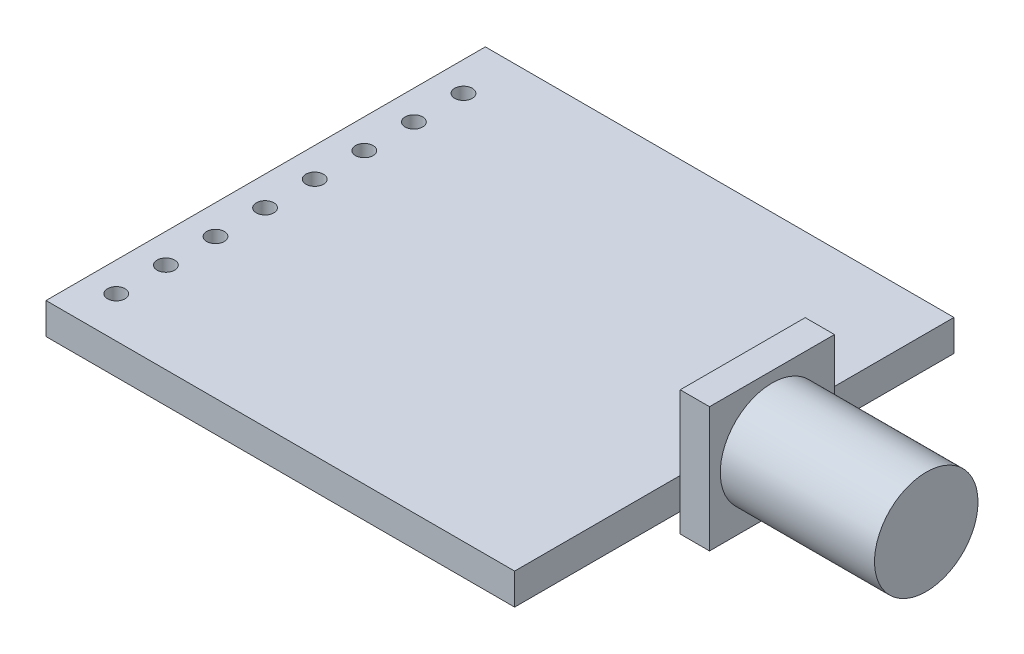
ISO-10303-21;
HEADER;
FILE_DESCRIPTION(('STEP AP214'),'2;1');
FILE_NAME('part.step','',(''),(''),'','','');
FILE_SCHEMA(('AUTOMOTIVE_DESIGN { 1 0 10303 214 1 1 1 1 }'));
ENDSEC;
DATA;
#1=APPLICATION_CONTEXT('core data for automotive mechanical design processes');
#2=APPLICATION_PROTOCOL_DEFINITION('international standard','automotive_design',2000,#1);
#3=PRODUCT_CONTEXT('',#1,'mechanical');
#4=PRODUCT('Part','Part','',(#3));
#5=PRODUCT_RELATED_PRODUCT_CATEGORY('part','',(#4));
#6=PRODUCT_DEFINITION_FORMATION('','',#4);
#7=PRODUCT_DEFINITION_CONTEXT('part definition',#1,'design');
#8=PRODUCT_DEFINITION('design','',#6,#7);
#9=PRODUCT_DEFINITION_SHAPE('','',#8);
#10=(LENGTH_UNIT() NAMED_UNIT(*) SI_UNIT(.MILLI.,.METRE.));
#11=(NAMED_UNIT(*) PLANE_ANGLE_UNIT() SI_UNIT($,.RADIAN.));
#12=(NAMED_UNIT(*) SI_UNIT($,.STERADIAN.) SOLID_ANGLE_UNIT());
#13=UNCERTAINTY_MEASURE_WITH_UNIT(LENGTH_MEASURE(1.E-05),#10,'distance_accuracy_value','');
#14=(GEOMETRIC_REPRESENTATION_CONTEXT(3) GLOBAL_UNCERTAINTY_ASSIGNED_CONTEXT((#13)) GLOBAL_UNIT_ASSIGNED_CONTEXT((#10,
#11,#12)) REPRESENTATION_CONTEXT('',''));
#15=CARTESIAN_POINT('',(0.,0.,0.));
#16=DIRECTION('',(0.,0.,1.));
#17=DIRECTION('',(1.,0.,0.));
#18=AXIS2_PLACEMENT_3D('',#15,#16,#17);
#19=CARTESIAN_POINT('',(-10.5,-1.,-8.63));
#20=DIRECTION('',(0.,1.,0.));
#21=DIRECTION('',(0.,0.,1.));
#22=AXIS2_PLACEMENT_3D('',#19,#20,#21);
#23=CYLINDRICAL_SURFACE('',#22,0.45);
#24=CARTESIAN_POINT('',(-10.5,1.6,-8.63));
#25=DIRECTION('',(0.,1.,0.));
#26=DIRECTION('',(0.,0.,1.));
#27=AXIS2_PLACEMENT_3D('',#24,#25,#26);
#28=CIRCLE('',#27,0.45);
#29=CARTESIAN_POINT('',(-10.5,1.6,-8.18));
#30=VERTEX_POINT('',#29);
#31=EDGE_CURVE('E49',#30,#30,#28,.T.);
#32=ORIENTED_EDGE('',*,*,#31,.T.);
#33=EDGE_LOOP('',(#32));
#34=FACE_BOUND('',#33,.T.);
#35=CARTESIAN_POINT('',(-10.5,0.,-8.63));
#36=DIRECTION('',(0.,1.,0.));
#37=DIRECTION('',(0.,0.,1.));
#38=AXIS2_PLACEMENT_3D('',#35,#36,#37);
#39=CIRCLE('',#38,0.45);
#40=CARTESIAN_POINT('',(-10.5,0.,-8.18));
#41=VERTEX_POINT('',#40);
#42=EDGE_CURVE('E11',#41,#41,#39,.T.);
#43=ORIENTED_EDGE('',*,*,#42,.F.);
#44=EDGE_LOOP('',(#43));
#45=FACE_BOUND('',#44,.T.);
#46=ADVANCED_FACE('F41',(#34,#45),#23,.F.);
#47=CARTESIAN_POINT('',(-10.5,-1.,-6.09));
#48=DIRECTION('',(0.,1.,0.));
#49=DIRECTION('',(0.,0.,1.));
#50=AXIS2_PLACEMENT_3D('',#47,#48,#49);
#51=CYLINDRICAL_SURFACE('',#50,0.45);
#52=CARTESIAN_POINT('',(-10.5,1.6,-6.09));
#53=DIRECTION('',(0.,1.,0.));
#54=DIRECTION('',(0.,0.,1.));
#55=AXIS2_PLACEMENT_3D('',#52,#53,#54);
#56=CIRCLE('',#55,0.45);
#57=CARTESIAN_POINT('',(-10.5,1.6,-5.64));
#58=VERTEX_POINT('',#57);
#59=EDGE_CURVE('E238',#58,#58,#56,.T.);
#60=ORIENTED_EDGE('',*,*,#59,.T.);
#61=EDGE_LOOP('',(#60));
#62=FACE_BOUND('',#61,.T.);
#63=CARTESIAN_POINT('',(-10.5,0.,-6.09));
#64=DIRECTION('',(0.,1.,0.));
#65=DIRECTION('',(0.,0.,1.));
#66=AXIS2_PLACEMENT_3D('',#63,#64,#65);
#67=CIRCLE('',#66,0.45);
#68=CARTESIAN_POINT('',(-10.5,0.,-5.64));
#69=VERTEX_POINT('',#68);
#70=EDGE_CURVE('E242',#69,#69,#67,.T.);
#71=ORIENTED_EDGE('',*,*,#70,.F.);
#72=EDGE_LOOP('',(#71));
#73=FACE_BOUND('',#72,.T.);
#74=ADVANCED_FACE('F271',(#62,#73),#51,.F.);
#75=CARTESIAN_POINT('',(-10.5,-1.,-3.55));
#76=DIRECTION('',(0.,1.,0.));
#77=DIRECTION('',(0.,0.,1.));
#78=AXIS2_PLACEMENT_3D('',#75,#76,#77);
#79=CYLINDRICAL_SURFACE('',#78,0.45);
#80=CARTESIAN_POINT('',(-10.5,1.6,-3.55));
#81=DIRECTION('',(0.,1.,0.));
#82=DIRECTION('',(0.,0.,1.));
#83=AXIS2_PLACEMENT_3D('',#80,#81,#82);
#84=CIRCLE('',#83,0.45);
#85=CARTESIAN_POINT('',(-10.5,1.6,-3.1));
#86=VERTEX_POINT('',#85);
#87=EDGE_CURVE('E230',#86,#86,#84,.T.);
#88=ORIENTED_EDGE('',*,*,#87,.T.);
#89=EDGE_LOOP('',(#88));
#90=FACE_BOUND('',#89,.T.);
#91=CARTESIAN_POINT('',(-10.5,0.,-3.55));
#92=DIRECTION('',(0.,1.,0.));
#93=DIRECTION('',(0.,0.,1.));
#94=AXIS2_PLACEMENT_3D('',#91,#92,#93);
#95=CIRCLE('',#94,0.45);
#96=CARTESIAN_POINT('',(-10.5,0.,-3.1));
#97=VERTEX_POINT('',#96);
#98=EDGE_CURVE('E234',#97,#97,#95,.T.);
#99=ORIENTED_EDGE('',*,*,#98,.F.);
#100=EDGE_LOOP('',(#99));
#101=FACE_BOUND('',#100,.T.);
#102=ADVANCED_FACE('F275',(#90,#101),#79,.F.);
#103=CARTESIAN_POINT('',(-10.5,-1.,-1.01));
#104=DIRECTION('',(0.,1.,0.));
#105=DIRECTION('',(0.,0.,1.));
#106=AXIS2_PLACEMENT_3D('',#103,#104,#105);
#107=CYLINDRICAL_SURFACE('',#106,0.45);
#108=CARTESIAN_POINT('',(-10.5,1.6,-1.01));
#109=DIRECTION('',(0.,1.,0.));
#110=DIRECTION('',(0.,0.,1.));
#111=AXIS2_PLACEMENT_3D('',#108,#109,#110);
#112=CIRCLE('',#111,0.45);
#113=CARTESIAN_POINT('',(-10.5,1.6,-0.56));
#114=VERTEX_POINT('',#113);
#115=EDGE_CURVE('E222',#114,#114,#112,.T.);
#116=ORIENTED_EDGE('',*,*,#115,.T.);
#117=EDGE_LOOP('',(#116));
#118=FACE_BOUND('',#117,.T.);
#119=CARTESIAN_POINT('',(-10.5,0.,-1.01));
#120=DIRECTION('',(0.,1.,0.));
#121=DIRECTION('',(0.,0.,1.));
#122=AXIS2_PLACEMENT_3D('',#119,#120,#121);
#123=CIRCLE('',#122,0.45);
#124=CARTESIAN_POINT('',(-10.5,0.,-0.56));
#125=VERTEX_POINT('',#124);
#126=EDGE_CURVE('E226',#125,#125,#123,.T.);
#127=ORIENTED_EDGE('',*,*,#126,.F.);
#128=EDGE_LOOP('',(#127));
#129=FACE_BOUND('',#128,.T.);
#130=ADVANCED_FACE('F280',(#118,#129),#107,.F.);
#131=CARTESIAN_POINT('',(-10.5,-1.,1.53));
#132=DIRECTION('',(0.,1.,0.));
#133=DIRECTION('',(0.,0.,1.));
#134=AXIS2_PLACEMENT_3D('',#131,#132,#133);
#135=CYLINDRICAL_SURFACE('',#134,0.45);
#136=CARTESIAN_POINT('',(-10.5,1.6,1.53));
#137=DIRECTION('',(0.,1.,0.));
#138=DIRECTION('',(0.,0.,1.));
#139=AXIS2_PLACEMENT_3D('',#136,#137,#138);
#140=CIRCLE('',#139,0.45);
#141=CARTESIAN_POINT('',(-10.5,1.6,1.98));
#142=VERTEX_POINT('',#141);
#143=EDGE_CURVE('E214',#142,#142,#140,.T.);
#144=ORIENTED_EDGE('',*,*,#143,.T.);
#145=EDGE_LOOP('',(#144));
#146=FACE_BOUND('',#145,.T.);
#147=CARTESIAN_POINT('',(-10.5,0.,1.53));
#148=DIRECTION('',(0.,1.,0.));
#149=DIRECTION('',(0.,0.,1.));
#150=AXIS2_PLACEMENT_3D('',#147,#148,#149);
#151=CIRCLE('',#150,0.45);
#152=CARTESIAN_POINT('',(-10.5,0.,1.98));
#153=VERTEX_POINT('',#152);
#154=EDGE_CURVE('E218',#153,#153,#151,.T.);
#155=ORIENTED_EDGE('',*,*,#154,.F.);
#156=EDGE_LOOP('',(#155));
#157=FACE_BOUND('',#156,.T.);
#158=ADVANCED_FACE('F287',(#146,#157),#135,.F.);
#159=CARTESIAN_POINT('',(-10.5,-1.,4.07));
#160=DIRECTION('',(0.,1.,0.));
#161=DIRECTION('',(0.,0.,1.));
#162=AXIS2_PLACEMENT_3D('',#159,#160,#161);
#163=CYLINDRICAL_SURFACE('',#162,0.45);
#164=CARTESIAN_POINT('',(-10.5,1.6,4.07));
#165=DIRECTION('',(0.,1.,0.));
#166=DIRECTION('',(0.,0.,1.));
#167=AXIS2_PLACEMENT_3D('',#164,#165,#166);
#168=CIRCLE('',#167,0.45);
#169=CARTESIAN_POINT('',(-10.5,1.6,4.52));
#170=VERTEX_POINT('',#169);
#171=EDGE_CURVE('E205',#170,#170,#168,.T.);
#172=ORIENTED_EDGE('',*,*,#171,.T.);
#173=EDGE_LOOP('',(#172));
#174=FACE_BOUND('',#173,.T.);
#175=CARTESIAN_POINT('',(-10.5,0.,4.07));
#176=DIRECTION('',(0.,1.,0.));
#177=DIRECTION('',(0.,0.,1.));
#178=AXIS2_PLACEMENT_3D('',#175,#176,#177);
#179=CIRCLE('',#178,0.45);
#180=CARTESIAN_POINT('',(-10.5,0.,4.52));
#181=VERTEX_POINT('',#180);
#182=EDGE_CURVE('E209',#181,#181,#179,.T.);
#183=ORIENTED_EDGE('',*,*,#182,.F.);
#184=EDGE_LOOP('',(#183));
#185=FACE_BOUND('',#184,.T.);
#186=ADVANCED_FACE('F291',(#174,#185),#163,.F.);
#187=CARTESIAN_POINT('',(12.,1.6,-11.25));
#188=DIRECTION('',(-1.,0.,0.));
#189=DIRECTION('',(0.,0.,1.));
#190=AXIS2_PLACEMENT_3D('',#187,#188,#189);
#191=PLANE('',#190);
#192=DIRECTION('',(0.,1.,0.));
#193=VECTOR('',#192,1.);
#194=CARTESIAN_POINT('',(12.,5.4,-3.63104152668825));
#195=LINE('',#194,#193);
#196=CARTESIAN_POINT('',(12.,0.,-3.63104152668825));
#197=VERTEX_POINT('',#196);
#198=CARTESIAN_POINT('',(12.,1.6,-3.63104152668825));
#199=VERTEX_POINT('',#198);
#200=EDGE_CURVE('E343',#197,#199,#195,.T.);
#201=ORIENTED_EDGE('',*,*,#200,.F.);
#202=DIRECTION('',(0.,0.,-1.));
#203=VECTOR('',#202,1.);
#204=CARTESIAN_POINT('',(12.,0.,-11.25));
#205=LINE('',#204,#203);
#206=CARTESIAN_POINT('',(12.,0.,-11.25));
#207=VERTEX_POINT('',#206);
#208=EDGE_CURVE('E149',#197,#207,#205,.T.);
#209=ORIENTED_EDGE('',*,*,#208,.T.);
#210=DIRECTION('',(0.,-1.,0.));
#211=VECTOR('',#210,1.);
#212=CARTESIAN_POINT('',(12.,1.6,-11.25));
#213=LINE('',#212,#211);
#214=CARTESIAN_POINT('',(12.,1.6,-11.25));
#215=VERTEX_POINT('',#214);
#216=EDGE_CURVE('E195',#215,#207,#213,.T.);
#217=ORIENTED_EDGE('',*,*,#216,.F.);
#218=DIRECTION('',(0.,0.,-1.));
#219=VECTOR('',#218,1.);
#220=CARTESIAN_POINT('',(12.,1.6,-11.25));
#221=LINE('',#220,#219);
#222=EDGE_CURVE('E56',#199,#215,#221,.T.);
#223=ORIENTED_EDGE('',*,*,#222,.F.);
#224=EDGE_LOOP('',(#201,#209,#217,#223));
#225=FACE_BOUND('',#224,.T.);
#226=ADVANCED_FACE('F295',(#225),#191,.F.);
#227=DIRECTION('',(0.,-1.,0.));
#228=VECTOR('',#227,1.);
#229=CARTESIAN_POINT('',(12.,5.4,2.76895847331175));
#230=LINE('',#229,#228);
#231=CARTESIAN_POINT('',(12.,1.6,2.76895847331175));
#232=VERTEX_POINT('',#231);
#233=CARTESIAN_POINT('',(12.,0.,2.76895847331175));
#234=VERTEX_POINT('',#233);
#235=EDGE_CURVE('E64',#232,#234,#230,.T.);
#236=ORIENTED_EDGE('',*,*,#235,.F.);
#237=CARTESIAN_POINT('',(12.,1.6,11.25));
#238=VERTEX_POINT('',#237);
#239=EDGE_CURVE('E160',#238,#232,#221,.T.);
#240=ORIENTED_EDGE('',*,*,#239,.F.);
#241=DIRECTION('',(0.,-1.,0.));
#242=VECTOR('',#241,1.);
#243=CARTESIAN_POINT('',(12.,1.6,11.25));
#244=LINE('',#243,#242);
#245=CARTESIAN_POINT('',(12.,0.,11.25));
#246=VERTEX_POINT('',#245);
#247=EDGE_CURVE('E172',#238,#246,#244,.T.);
#248=ORIENTED_EDGE('',*,*,#247,.T.);
#249=EDGE_CURVE('E155',#246,#234,#205,.T.);
#250=ORIENTED_EDGE('',*,*,#249,.T.);
#251=EDGE_LOOP('',(#236,#240,#248,#250));
#252=FACE_BOUND('',#251,.T.);
#253=ADVANCED_FACE('F299',(#252),#191,.F.);
#254=CARTESIAN_POINT('',(-12.,1.6,-11.25));
#255=DIRECTION('',(0.,0.,1.));
#256=DIRECTION('',(1.,0.,0.));
#257=AXIS2_PLACEMENT_3D('',#254,#255,#256);
#258=PLANE('',#257);
#259=DIRECTION('',(-1.,0.,0.));
#260=VECTOR('',#259,1.);
#261=CARTESIAN_POINT('',(-12.,0.,-11.25));
#262=LINE('',#261,#260);
#263=CARTESIAN_POINT('',(-12.,0.,-11.25));
#264=VERTEX_POINT('',#263);
#265=EDGE_CURVE('E175',#207,#264,#262,.T.);
#266=ORIENTED_EDGE('',*,*,#265,.T.);
#267=DIRECTION('',(0.,-1.,0.));
#268=VECTOR('',#267,1.);
#269=CARTESIAN_POINT('',(-12.,1.6,-11.25));
#270=LINE('',#269,#268);
#271=CARTESIAN_POINT('',(-12.,1.6,-11.25));
#272=VERTEX_POINT('',#271);
#273=EDGE_CURVE('E191',#272,#264,#270,.T.);
#274=ORIENTED_EDGE('',*,*,#273,.F.);
#275=DIRECTION('',(-1.,0.,0.));
#276=VECTOR('',#275,1.);
#277=CARTESIAN_POINT('',(-12.,1.6,-11.25));
#278=LINE('',#277,#276);
#279=EDGE_CURVE('E163',#215,#272,#278,.T.);
#280=ORIENTED_EDGE('',*,*,#279,.F.);
#281=ORIENTED_EDGE('',*,*,#216,.T.);
#282=EDGE_LOOP('',(#266,#274,#280,#281));
#283=FACE_BOUND('',#282,.T.);
#284=ADVANCED_FACE('F300',(#283),#258,.F.);
#285=CARTESIAN_POINT('',(-12.,1.6,-11.25));
#286=DIRECTION('',(1.,0.,0.));
#287=DIRECTION('',(0.,0.,-1.));
#288=AXIS2_PLACEMENT_3D('',#285,#286,#287);
#289=PLANE('',#288);
#290=DIRECTION('',(0.,0.,1.));
#291=VECTOR('',#290,1.);
#292=CARTESIAN_POINT('',(-12.,0.,-11.25));
#293=LINE('',#292,#291);
#294=CARTESIAN_POINT('',(-12.,0.,11.25));
#295=VERTEX_POINT('',#294);
#296=EDGE_CURVE('E178',#264,#295,#293,.T.);
#297=ORIENTED_EDGE('',*,*,#296,.T.);
#298=DIRECTION('',(0.,-1.,0.));
#299=VECTOR('',#298,1.);
#300=CARTESIAN_POINT('',(-12.,1.6,11.25));
#301=LINE('',#300,#299);
#302=CARTESIAN_POINT('',(-12.,1.6,11.25));
#303=VERTEX_POINT('',#302);
#304=EDGE_CURVE('E187',#303,#295,#301,.T.);
#305=ORIENTED_EDGE('',*,*,#304,.F.);
#306=DIRECTION('',(0.,0.,1.));
#307=VECTOR('',#306,1.);
#308=CARTESIAN_POINT('',(-12.,1.6,-11.25));
#309=LINE('',#308,#307);
#310=EDGE_CURVE('E167',#272,#303,#309,.T.);
#311=ORIENTED_EDGE('',*,*,#310,.F.);
#312=ORIENTED_EDGE('',*,*,#273,.T.);
#313=EDGE_LOOP('',(#297,#305,#311,#312));
#314=FACE_BOUND('',#313,.T.);
#315=ADVANCED_FACE('F264',(#314),#289,.F.);
#316=CARTESIAN_POINT('',(-12.,1.6,11.25));
#317=DIRECTION('',(0.,0.,-1.));
#318=DIRECTION('',(-1.,0.,0.));
#319=AXIS2_PLACEMENT_3D('',#316,#317,#318);
#320=PLANE('',#319);
#321=DIRECTION('',(1.,0.,0.));
#322=VECTOR('',#321,1.);
#323=CARTESIAN_POINT('',(-12.,0.,11.25));
#324=LINE('',#323,#322);
#325=EDGE_CURVE('E181',#295,#246,#324,.T.);
#326=ORIENTED_EDGE('',*,*,#325,.T.);
#327=ORIENTED_EDGE('',*,*,#247,.F.);
#328=DIRECTION('',(1.,0.,0.));
#329=VECTOR('',#328,1.);
#330=CARTESIAN_POINT('',(-12.,1.6,11.25));
#331=LINE('',#330,#329);
#332=EDGE_CURVE('E170',#303,#238,#331,.T.);
#333=ORIENTED_EDGE('',*,*,#332,.F.);
#334=ORIENTED_EDGE('',*,*,#304,.T.);
#335=EDGE_LOOP('',(#326,#327,#333,#334));
#336=FACE_BOUND('',#335,.T.);
#337=ADVANCED_FACE('F254',(#336),#320,.F.);
#338=CARTESIAN_POINT('',(0.,1.6,0.));
#339=DIRECTION('',(0.,1.,0.));
#340=DIRECTION('',(0.,0.,1.));
#341=AXIS2_PLACEMENT_3D('',#338,#339,#340);
#342=PLANE('',#341);
#343=CARTESIAN_POINT('',(-10.5,1.6,6.61));
#344=DIRECTION('',(0.,1.,0.));
#345=DIRECTION('',(0.,0.,1.));
#346=AXIS2_PLACEMENT_3D('',#343,#344,#345);
#347=CIRCLE('',#346,0.45);
#348=CARTESIAN_POINT('',(-10.5,1.6,7.06));
#349=VERTEX_POINT('',#348);
#350=EDGE_CURVE('E412',#349,#349,#347,.T.);
#351=ORIENTED_EDGE('',*,*,#350,.F.);
#352=EDGE_LOOP('',(#351));
#353=FACE_BOUND('',#352,.T.);
#354=CARTESIAN_POINT('',(-10.5,1.6,9.15));
#355=DIRECTION('',(0.,1.,0.));
#356=DIRECTION('',(0.,0.,1.));
#357=AXIS2_PLACEMENT_3D('',#354,#355,#356);
#358=CIRCLE('',#357,0.45);
#359=CARTESIAN_POINT('',(-10.5,1.6,9.6));
#360=VERTEX_POINT('',#359);
#361=EDGE_CURVE('E204',#360,#360,#358,.T.);
#362=ORIENTED_EDGE('',*,*,#361,.F.);
#363=EDGE_LOOP('',(#362));
#364=FACE_BOUND('',#363,.T.);
#365=ORIENTED_EDGE('',*,*,#239,.T.);
#366=EDGE_CURVE('E164',#232,#199,#221,.T.);
#367=ORIENTED_EDGE('',*,*,#366,.T.);
#368=ORIENTED_EDGE('',*,*,#222,.T.);
#369=ORIENTED_EDGE('',*,*,#279,.T.);
#370=ORIENTED_EDGE('',*,*,#310,.T.);
#371=ORIENTED_EDGE('',*,*,#332,.T.);
#372=EDGE_LOOP('',(#365,#367,#368,#369,#370,#371));
#373=FACE_BOUND('',#372,.T.);
#374=ORIENTED_EDGE('',*,*,#171,.F.);
#375=EDGE_LOOP('',(#374));
#376=FACE_BOUND('',#375,.T.);
#377=ORIENTED_EDGE('',*,*,#143,.F.);
#378=EDGE_LOOP('',(#377));
#379=FACE_BOUND('',#378,.T.);
#380=ORIENTED_EDGE('',*,*,#115,.F.);
#381=EDGE_LOOP('',(#380));
#382=FACE_BOUND('',#381,.T.);
#383=ORIENTED_EDGE('',*,*,#87,.F.);
#384=EDGE_LOOP('',(#383));
#385=FACE_BOUND('',#384,.T.);
#386=ORIENTED_EDGE('',*,*,#59,.F.);
#387=EDGE_LOOP('',(#386));
#388=FACE_BOUND('',#387,.T.);
#389=ORIENTED_EDGE('',*,*,#31,.F.);
#390=EDGE_LOOP('',(#389));
#391=FACE_BOUND('',#390,.T.);
#392=ADVANCED_FACE('F251',(#353,#364,#373,#376,#379,#382,#385,#388,#391),#342,.T.);
#393=CARTESIAN_POINT('',(0.,0.,0.));
#394=DIRECTION('',(0.,1.,0.));
#395=DIRECTION('',(0.,0.,1.));
#396=AXIS2_PLACEMENT_3D('',#393,#394,#395);
#397=PLANE('',#396);
#398=CARTESIAN_POINT('',(-10.5,0.,6.61));
#399=DIRECTION('',(0.,1.,0.));
#400=DIRECTION('',(0.,0.,1.));
#401=AXIS2_PLACEMENT_3D('',#398,#399,#400);
#402=CIRCLE('',#401,0.45);
#403=CARTESIAN_POINT('',(-10.5,0.,7.06));
#404=VERTEX_POINT('',#403);
#405=EDGE_CURVE('E415',#404,#404,#402,.T.);
#406=ORIENTED_EDGE('',*,*,#405,.T.);
#407=EDGE_LOOP('',(#406));
#408=FACE_BOUND('',#407,.T.);
#409=CARTESIAN_POINT('',(-10.5,0.,9.15));
#410=DIRECTION('',(0.,1.,0.));
#411=DIRECTION('',(0.,0.,1.));
#412=AXIS2_PLACEMENT_3D('',#409,#410,#411);
#413=CIRCLE('',#412,0.45);
#414=CARTESIAN_POINT('',(-10.5,0.,9.6));
#415=VERTEX_POINT('',#414);
#416=EDGE_CURVE('E199',#415,#415,#413,.T.);
#417=ORIENTED_EDGE('',*,*,#416,.T.);
#418=EDGE_LOOP('',(#417));
#419=FACE_BOUND('',#418,.T.);
#420=ORIENTED_EDGE('',*,*,#249,.F.);
#421=ORIENTED_EDGE('',*,*,#325,.F.);
#422=ORIENTED_EDGE('',*,*,#296,.F.);
#423=ORIENTED_EDGE('',*,*,#265,.F.);
#424=ORIENTED_EDGE('',*,*,#208,.F.);
#425=EDGE_CURVE('E153',#234,#197,#205,.T.);
#426=ORIENTED_EDGE('',*,*,#425,.F.);
#427=EDGE_LOOP('',(#420,#421,#422,#423,#424,#426));
#428=FACE_BOUND('',#427,.T.);
#429=ORIENTED_EDGE('',*,*,#182,.T.);
#430=EDGE_LOOP('',(#429));
#431=FACE_BOUND('',#430,.T.);
#432=ORIENTED_EDGE('',*,*,#154,.T.);
#433=EDGE_LOOP('',(#432));
#434=FACE_BOUND('',#433,.T.);
#435=ORIENTED_EDGE('',*,*,#126,.T.);
#436=EDGE_LOOP('',(#435));
#437=FACE_BOUND('',#436,.T.);
#438=ORIENTED_EDGE('',*,*,#98,.T.);
#439=EDGE_LOOP('',(#438));
#440=FACE_BOUND('',#439,.T.);
#441=ORIENTED_EDGE('',*,*,#70,.T.);
#442=EDGE_LOOP('',(#441));
#443=FACE_BOUND('',#442,.T.);
#444=ORIENTED_EDGE('',*,*,#42,.T.);
#445=EDGE_LOOP('',(#444));
#446=FACE_BOUND('',#445,.T.);
#447=ADVANCED_FACE('F253',(#408,#419,#428,#431,#434,#437,#440,#443,#446),#397,.F.);
#448=CARTESIAN_POINT('',(12.,0.,0.));
#449=DIRECTION('',(1.,0.,0.));
#450=DIRECTION('',(0.,0.,-1.));
#451=AXIS2_PLACEMENT_3D('',#448,#449,#450);
#452=PLANE('',#451);
#453=CARTESIAN_POINT('',(12.,-1.,2.76895847331175));
#454=VERTEX_POINT('',#453);
#455=EDGE_CURVE('E335',#234,#454,#230,.T.);
#456=ORIENTED_EDGE('',*,*,#455,.F.);
#457=ORIENTED_EDGE('',*,*,#425,.T.);
#458=CARTESIAN_POINT('',(12.,-1.,-3.63104152668825));
#459=VERTEX_POINT('',#458);
#460=EDGE_CURVE('E346',#459,#197,#195,.T.);
#461=ORIENTED_EDGE('',*,*,#460,.F.);
#462=DIRECTION('',(0.,0.,-1.));
#463=VECTOR('',#462,1.);
#464=CARTESIAN_POINT('',(12.,-1.,2.76895847331175));
#465=LINE('',#464,#463);
#466=EDGE_CURVE('E140',#454,#459,#465,.T.);
#467=ORIENTED_EDGE('',*,*,#466,.F.);
#468=EDGE_LOOP('',(#456,#457,#461,#467));
#469=FACE_BOUND('',#468,.T.);
#470=ADVANCED_FACE('F261',(#469),#452,.F.);
#471=CARTESIAN_POINT('',(13.5,5.4,-3.63104152668825));
#472=DIRECTION('',(0.,0.,1.));
#473=DIRECTION('',(1.,0.,0.));
#474=AXIS2_PLACEMENT_3D('',#471,#472,#473);
#475=PLANE('',#474);
#476=ORIENTED_EDGE('',*,*,#460,.T.);
#477=ORIENTED_EDGE('',*,*,#200,.T.);
#478=CARTESIAN_POINT('',(12.,5.4,-3.63104152668825));
#479=VERTEX_POINT('',#478);
#480=EDGE_CURVE('E146',#199,#479,#195,.T.);
#481=ORIENTED_EDGE('',*,*,#480,.T.);
#482=DIRECTION('',(-1.,0.,0.));
#483=VECTOR('',#482,1.);
#484=CARTESIAN_POINT('',(13.5,5.4,-3.63104152668825));
#485=LINE('',#484,#483);
#486=CARTESIAN_POINT('',(13.5,5.4,-3.63104152668825));
#487=VERTEX_POINT('',#486);
#488=EDGE_CURVE('E123',#487,#479,#485,.T.);
#489=ORIENTED_EDGE('',*,*,#488,.F.);
#490=DIRECTION('',(0.,1.,0.));
#491=VECTOR('',#490,1.);
#492=CARTESIAN_POINT('',(13.5,5.4,-3.63104152668825));
#493=LINE('',#492,#491);
#494=CARTESIAN_POINT('',(13.5,-1.,-3.63104152668825));
#495=VERTEX_POINT('',#494);
#496=EDGE_CURVE('E130',#495,#487,#493,.T.);
#497=ORIENTED_EDGE('',*,*,#496,.F.);
#498=DIRECTION('',(-1.,0.,0.));
#499=VECTOR('',#498,1.);
#500=CARTESIAN_POINT('',(13.5,-1.,-3.63104152668825));
#501=LINE('',#500,#499);
#502=EDGE_CURVE('E363',#495,#459,#501,.T.);
#503=ORIENTED_EDGE('',*,*,#502,.T.);
#504=EDGE_LOOP('',(#476,#477,#481,#489,#497,#503));
#505=FACE_BOUND('',#504,.T.);
#506=ADVANCED_FACE('F143',(#505),#475,.F.);
#507=CARTESIAN_POINT('',(13.5,5.4,2.76895847331175));
#508=DIRECTION('',(0.,-1.,0.));
#509=DIRECTION('',(0.,0.,-1.));
#510=AXIS2_PLACEMENT_3D('',#507,#508,#509);
#511=PLANE('',#510);
#512=DIRECTION('',(0.,0.,1.));
#513=VECTOR('',#512,1.);
#514=CARTESIAN_POINT('',(12.,5.4,2.76895847331175));
#515=LINE('',#514,#513);
#516=CARTESIAN_POINT('',(12.,5.4,2.76895847331175));
#517=VERTEX_POINT('',#516);
#518=EDGE_CURVE('E340',#479,#517,#515,.T.);
#519=ORIENTED_EDGE('',*,*,#518,.T.);
#520=DIRECTION('',(-1.,0.,0.));
#521=VECTOR('',#520,1.);
#522=CARTESIAN_POINT('',(13.5,5.4,2.76895847331175));
#523=LINE('',#522,#521);
#524=CARTESIAN_POINT('',(13.5,5.4,2.76895847331175));
#525=VERTEX_POINT('',#524);
#526=EDGE_CURVE('E125',#525,#517,#523,.T.);
#527=ORIENTED_EDGE('',*,*,#526,.F.);
#528=DIRECTION('',(0.,0.,1.));
#529=VECTOR('',#528,1.);
#530=CARTESIAN_POINT('',(13.5,5.4,2.76895847331175));
#531=LINE('',#530,#529);
#532=EDGE_CURVE('E119',#487,#525,#531,.T.);
#533=ORIENTED_EDGE('',*,*,#532,.F.);
#534=ORIENTED_EDGE('',*,*,#488,.T.);
#535=EDGE_LOOP('',(#519,#527,#533,#534));
#536=FACE_BOUND('',#535,.T.);
#537=ADVANCED_FACE('F121',(#536),#511,.F.);
#538=CARTESIAN_POINT('',(13.5,5.4,2.76895847331175));
#539=DIRECTION('',(0.,0.,-1.));
#540=DIRECTION('',(-1.,0.,0.));
#541=AXIS2_PLACEMENT_3D('',#538,#539,#540);
#542=PLANE('',#541);
#543=EDGE_CURVE('E330',#517,#232,#230,.T.);
#544=ORIENTED_EDGE('',*,*,#543,.T.);
#545=ORIENTED_EDGE('',*,*,#235,.T.);
#546=ORIENTED_EDGE('',*,*,#455,.T.);
#547=DIRECTION('',(-1.,0.,0.));
#548=VECTOR('',#547,1.);
#549=CARTESIAN_POINT('',(13.5,-1.,2.76895847331175));
#550=LINE('',#549,#548);
#551=CARTESIAN_POINT('',(13.5,-1.,2.76895847331175));
#552=VERTEX_POINT('',#551);
#553=EDGE_CURVE('E156',#552,#454,#550,.T.);
#554=ORIENTED_EDGE('',*,*,#553,.F.);
#555=DIRECTION('',(0.,-1.,0.));
#556=VECTOR('',#555,1.);
#557=CARTESIAN_POINT('',(13.5,5.4,2.76895847331175));
#558=LINE('',#557,#556);
#559=EDGE_CURVE('E129',#525,#552,#558,.T.);
#560=ORIENTED_EDGE('',*,*,#559,.F.);
#561=ORIENTED_EDGE('',*,*,#526,.T.);
#562=EDGE_LOOP('',(#544,#545,#546,#554,#560,#561));
#563=FACE_BOUND('',#562,.T.);
#564=ADVANCED_FACE('F333',(#563),#542,.F.);
#565=CARTESIAN_POINT('',(13.5,-1.,2.76895847331175));
#566=DIRECTION('',(0.,1.,0.));
#567=DIRECTION('',(0.,0.,1.));
#568=AXIS2_PLACEMENT_3D('',#565,#566,#567);
#569=PLANE('',#568);
#570=ORIENTED_EDGE('',*,*,#466,.T.);
#571=ORIENTED_EDGE('',*,*,#502,.F.);
#572=DIRECTION('',(0.,0.,-1.));
#573=VECTOR('',#572,1.);
#574=CARTESIAN_POINT('',(13.5,-1.,2.76895847331175));
#575=LINE('',#574,#573);
#576=EDGE_CURVE('E135',#552,#495,#575,.T.);
#577=ORIENTED_EDGE('',*,*,#576,.F.);
#578=ORIENTED_EDGE('',*,*,#553,.T.);
#579=EDGE_LOOP('',(#570,#571,#577,#578));
#580=FACE_BOUND('',#579,.T.);
#581=ADVANCED_FACE('F372',(#580),#569,.F.);
#582=CARTESIAN_POINT('',(13.5,0.,0.));
#583=DIRECTION('',(1.,0.,0.));
#584=DIRECTION('',(0.,0.,-1.));
#585=AXIS2_PLACEMENT_3D('',#582,#583,#584);
#586=PLANE('',#585);
#587=CARTESIAN_POINT('',(13.5,2.2,-0.431041526688252));
#588=DIRECTION('',(1.,0.,0.));
#589=DIRECTION('',(0.,0.,-1.));
#590=AXIS2_PLACEMENT_3D('',#587,#588,#589);
#591=CIRCLE('',#590,2.65);
#592=CARTESIAN_POINT('',(13.5,2.2,-3.08104152668825));
#593=VERTEX_POINT('',#592);
#594=EDGE_CURVE('E210',#593,#593,#591,.T.);
#595=ORIENTED_EDGE('',*,*,#594,.F.);
#596=EDGE_LOOP('',(#595));
#597=FACE_BOUND('',#596,.T.);
#598=ORIENTED_EDGE('',*,*,#496,.T.);
#599=ORIENTED_EDGE('',*,*,#532,.T.);
#600=ORIENTED_EDGE('',*,*,#559,.T.);
#601=ORIENTED_EDGE('',*,*,#576,.T.);
#602=EDGE_LOOP('',(#598,#599,#600,#601));
#603=FACE_BOUND('',#602,.T.);
#604=ADVANCED_FACE('F133',(#597,#603),#586,.T.);
#605=ORIENTED_EDGE('',*,*,#366,.F.);
#606=ORIENTED_EDGE('',*,*,#543,.F.);
#607=ORIENTED_EDGE('',*,*,#518,.F.);
#608=ORIENTED_EDGE('',*,*,#480,.F.);
#609=EDGE_LOOP('',(#605,#606,#607,#608));
#610=FACE_BOUND('',#609,.T.);
#611=ADVANCED_FACE('F329',(#610),#452,.F.);
#612=CARTESIAN_POINT('',(21.4,2.2,-0.431041526688252));
#613=DIRECTION('',(-1.,0.,0.));
#614=DIRECTION('',(0.,0.,1.));
#615=AXIS2_PLACEMENT_3D('',#612,#613,#614);
#616=CYLINDRICAL_SURFACE('',#615,2.65);
#617=CARTESIAN_POINT('',(21.4,2.2,-0.431041526688252));
#618=DIRECTION('',(1.,0.,0.));
#619=DIRECTION('',(0.,0.,-1.));
#620=AXIS2_PLACEMENT_3D('',#617,#618,#619);
#621=CIRCLE('',#620,2.65);
#622=CARTESIAN_POINT('',(21.4,2.2,-3.08104152668825));
#623=VERTEX_POINT('',#622);
#624=EDGE_CURVE('E203',#623,#623,#621,.T.);
#625=ORIENTED_EDGE('',*,*,#624,.F.);
#626=EDGE_LOOP('',(#625));
#627=FACE_BOUND('',#626,.T.);
#628=ORIENTED_EDGE('',*,*,#594,.T.);
#629=EDGE_LOOP('',(#628));
#630=FACE_BOUND('',#629,.T.);
#631=ADVANCED_FACE('F385',(#627,#630),#616,.T.);
#632=CARTESIAN_POINT('',(21.4,2.2,-0.431041526688252));
#633=DIRECTION('',(1.,0.,0.));
#634=DIRECTION('',(0.,0.,-1.));
#635=AXIS2_PLACEMENT_3D('',#632,#633,#634);
#636=PLANE('',#635);
#637=ORIENTED_EDGE('',*,*,#624,.T.);
#638=EDGE_LOOP('',(#637));
#639=FACE_BOUND('',#638,.T.);
#640=ADVANCED_FACE('F390',(#639),#636,.T.);
#641=CARTESIAN_POINT('',(-10.5,-1.,9.15));
#642=DIRECTION('',(0.,1.,0.));
#643=DIRECTION('',(0.,0.,1.));
#644=AXIS2_PLACEMENT_3D('',#641,#642,#643);
#645=CYLINDRICAL_SURFACE('',#644,0.45);
#646=ORIENTED_EDGE('',*,*,#361,.T.);
#647=EDGE_LOOP('',(#646));
#648=FACE_BOUND('',#647,.T.);
#649=ORIENTED_EDGE('',*,*,#416,.F.);
#650=EDGE_LOOP('',(#649));
#651=FACE_BOUND('',#650,.T.);
#652=ADVANCED_FACE('F401',(#648,#651),#645,.F.);
#653=CARTESIAN_POINT('',(-10.5,-1.,6.61));
#654=DIRECTION('',(0.,1.,0.));
#655=DIRECTION('',(0.,0.,1.));
#656=AXIS2_PLACEMENT_3D('',#653,#654,#655);
#657=CYLINDRICAL_SURFACE('',#656,0.45);
#658=ORIENTED_EDGE('',*,*,#350,.T.);
#659=EDGE_LOOP('',(#658));
#660=FACE_BOUND('',#659,.T.);
#661=ORIENTED_EDGE('',*,*,#405,.F.);
#662=EDGE_LOOP('',(#661));
#663=FACE_BOUND('',#662,.T.);
#664=ADVANCED_FACE('F404',(#660,#663),#657,.F.);
#665=CLOSED_SHELL('',(#46,#74,#102,#130,#158,#186,#226,#253,#284,#315,#337,#392,#447,#470,#506,
#537,#564,#581,#604,#611,#631,#640,#652,#664));
#666=MANIFOLD_SOLID_BREP('B2',#665);
#667=ADVANCED_BREP_SHAPE_REPRESENTATION('',(#18,#666),#14);
#668=SHAPE_DEFINITION_REPRESENTATION(#9,#667);
ENDSEC;
END-ISO-10303-21;
